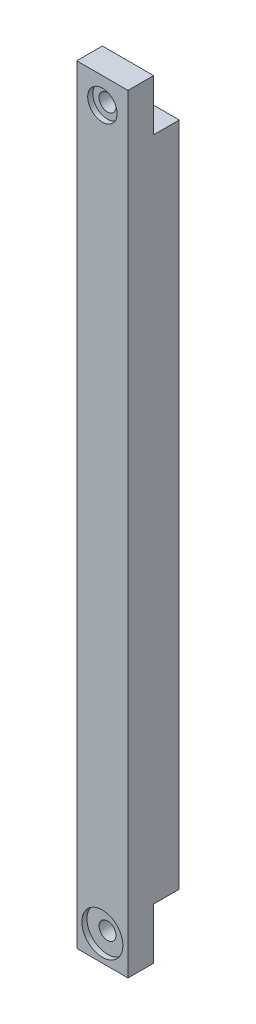
ISO-10303-21;
HEADER;
FILE_DESCRIPTION(('STEP AP214'),'2;1');
FILE_NAME('part.step','',(''),(''),'','','');
FILE_SCHEMA(('AUTOMOTIVE_DESIGN { 1 0 10303 214 1 1 1 1 }'));
ENDSEC;
DATA;
#1=APPLICATION_CONTEXT('core data for automotive mechanical design processes');
#2=APPLICATION_PROTOCOL_DEFINITION('international standard','automotive_design',2000,#1);
#3=PRODUCT_CONTEXT('',#1,'mechanical');
#4=PRODUCT('Part','Part','',(#3));
#5=PRODUCT_RELATED_PRODUCT_CATEGORY('part','',(#4));
#6=PRODUCT_DEFINITION_FORMATION('','',#4);
#7=PRODUCT_DEFINITION_CONTEXT('part definition',#1,'design');
#8=PRODUCT_DEFINITION('design','',#6,#7);
#9=PRODUCT_DEFINITION_SHAPE('','',#8);
#10=(LENGTH_UNIT() NAMED_UNIT(*) SI_UNIT(.MILLI.,.METRE.));
#11=(NAMED_UNIT(*) PLANE_ANGLE_UNIT() SI_UNIT($,.RADIAN.));
#12=(NAMED_UNIT(*) SI_UNIT($,.STERADIAN.) SOLID_ANGLE_UNIT());
#13=UNCERTAINTY_MEASURE_WITH_UNIT(LENGTH_MEASURE(1.E-05),#10,'distance_accuracy_value','');
#14=(GEOMETRIC_REPRESENTATION_CONTEXT(3) GLOBAL_UNCERTAINTY_ASSIGNED_CONTEXT((#13)) GLOBAL_UNIT_ASSIGNED_CONTEXT((#10,
#11,#12)) REPRESENTATION_CONTEXT('',''));
#15=CARTESIAN_POINT('',(0.,0.,0.));
#16=DIRECTION('',(0.,0.,1.));
#17=DIRECTION('',(1.,0.,0.));
#18=AXIS2_PLACEMENT_3D('',#15,#16,#17);
#19=CARTESIAN_POINT('',(5.00000000000003,-145.,10.));
#20=DIRECTION('',(0.,0.,1.));
#21=DIRECTION('',(1.,0.,0.));
#22=AXIS2_PLACEMENT_3D('',#19,#20,#21);
#23=CYLINDRICAL_SURFACE('',#22,1.65);
#24=CARTESIAN_POINT('',(5.00000000000003,-145.,5.));
#25=DIRECTION('',(0.,0.,1.));
#26=DIRECTION('',(1.,0.,0.));
#27=AXIS2_PLACEMENT_3D('',#24,#25,#26);
#28=CIRCLE('',#27,1.65);
#29=CARTESIAN_POINT('',(6.65000000000003,-145.,5.));
#30=VERTEX_POINT('',#29);
#31=EDGE_CURVE('E145',#30,#30,#28,.T.);
#32=ORIENTED_EDGE('',*,*,#31,.F.);
#33=EDGE_LOOP('',(#32));
#34=FACE_BOUND('',#33,.T.);
#35=CARTESIAN_POINT('',(5.00000000000003,-145.,9.));
#36=DIRECTION('',(0.,0.,1.));
#37=DIRECTION('',(1.,0.,0.));
#38=AXIS2_PLACEMENT_3D('',#35,#36,#37);
#39=CIRCLE('',#38,1.65);
#40=CARTESIAN_POINT('',(6.65000000000003,-145.,9.));
#41=VERTEX_POINT('',#40);
#42=EDGE_CURVE('E42',#41,#41,#39,.F.);
#43=ORIENTED_EDGE('',*,*,#42,.F.);
#44=EDGE_LOOP('',(#43));
#45=FACE_BOUND('',#44,.T.);
#46=ADVANCED_FACE('F38',(#34,#45),#23,.F.);
#47=CARTESIAN_POINT('',(5.00000000000001,-5.,10.));
#48=DIRECTION('',(0.,0.,1.));
#49=DIRECTION('',(1.,0.,0.));
#50=AXIS2_PLACEMENT_3D('',#47,#48,#49);
#51=CYLINDRICAL_SURFACE('',#50,1.65);
#52=CARTESIAN_POINT('',(5.00000000000001,-5.,5.));
#53=DIRECTION('',(0.,0.,-1.));
#54=DIRECTION('',(-1.,0.,0.));
#55=AXIS2_PLACEMENT_3D('',#52,#53,#54);
#56=CIRCLE('',#55,1.65);
#57=CARTESIAN_POINT('',(3.35000000000001,-5.,5.));
#58=VERTEX_POINT('',#57);
#59=EDGE_CURVE('E173',#58,#58,#56,.T.);
#60=ORIENTED_EDGE('',*,*,#59,.T.);
#61=EDGE_LOOP('',(#60));
#62=FACE_BOUND('',#61,.T.);
#63=CARTESIAN_POINT('',(5.00000000000001,-5.,9.));
#64=DIRECTION('',(0.,0.,1.));
#65=DIRECTION('',(1.,0.,0.));
#66=AXIS2_PLACEMENT_3D('',#63,#64,#65);
#67=CIRCLE('',#66,1.65);
#68=CARTESIAN_POINT('',(6.65000000000001,-5.,9.));
#69=VERTEX_POINT('',#68);
#70=EDGE_CURVE('E167',#69,#69,#67,.F.);
#71=ORIENTED_EDGE('',*,*,#70,.F.);
#72=EDGE_LOOP('',(#71));
#73=FACE_BOUND('',#72,.T.);
#74=ADVANCED_FACE('F215',(#62,#73),#51,.F.);
#75=CARTESIAN_POINT('',(0.,0.,10.));
#76=DIRECTION('',(0.,-1.,0.));
#77=DIRECTION('',(0.,0.,-1.));
#78=AXIS2_PLACEMENT_3D('',#75,#76,#77);
#79=PLANE('',#78);
#80=DIRECTION('',(1.,0.,0.));
#81=VECTOR('',#80,1.);
#82=CARTESIAN_POINT('',(10.,0.,5.));
#83=LINE('',#82,#81);
#84=CARTESIAN_POINT('',(0.,0.,5.));
#85=VERTEX_POINT('',#84);
#86=CARTESIAN_POINT('',(10.,0.,5.));
#87=VERTEX_POINT('',#86);
#88=EDGE_CURVE('E117',#85,#87,#83,.T.);
#89=ORIENTED_EDGE('',*,*,#88,.F.);
#90=DIRECTION('',(0.,0.,-1.));
#91=VECTOR('',#90,1.);
#92=CARTESIAN_POINT('',(0.,0.,10.));
#93=LINE('',#92,#91);
#94=CARTESIAN_POINT('',(0.,0.,10.));
#95=VERTEX_POINT('',#94);
#96=EDGE_CURVE('E158',#95,#85,#93,.T.);
#97=ORIENTED_EDGE('',*,*,#96,.F.);
#98=DIRECTION('',(-1.,0.,0.));
#99=VECTOR('',#98,1.);
#100=CARTESIAN_POINT('',(0.,0.,10.));
#101=LINE('',#100,#99);
#102=CARTESIAN_POINT('',(10.,0.,10.));
#103=VERTEX_POINT('',#102);
#104=EDGE_CURVE('E156',#103,#95,#101,.T.);
#105=ORIENTED_EDGE('',*,*,#104,.F.);
#106=DIRECTION('',(0.,0.,-1.));
#107=VECTOR('',#106,1.);
#108=CARTESIAN_POINT('',(10.,0.,10.));
#109=LINE('',#108,#107);
#110=EDGE_CURVE('E164',#103,#87,#109,.T.);
#111=ORIENTED_EDGE('',*,*,#110,.T.);
#112=EDGE_LOOP('',(#89,#97,#105,#111));
#113=FACE_BOUND('',#112,.T.);
#114=ADVANCED_FACE('F213',(#113),#79,.F.);
#115=CARTESIAN_POINT('',(0.,0.,10.));
#116=DIRECTION('',(1.,0.,0.));
#117=DIRECTION('',(0.,1.,0.));
#118=AXIS2_PLACEMENT_3D('',#115,#116,#117);
#119=PLANE('',#118);
#120=DIRECTION('',(0.,1.,0.));
#121=VECTOR('',#120,1.);
#122=CARTESIAN_POINT('',(0.,0.,5.));
#123=LINE('',#122,#121);
#124=CARTESIAN_POINT('',(0.,-10.,5.));
#125=VERTEX_POINT('',#124);
#126=EDGE_CURVE('E111',#125,#85,#123,.T.);
#127=ORIENTED_EDGE('',*,*,#126,.F.);
#128=DIRECTION('',(0.,0.,-1.));
#129=VECTOR('',#128,1.);
#130=CARTESIAN_POINT('',(0.,-10.,5.));
#131=LINE('',#130,#129);
#132=CARTESIAN_POINT('',(0.,-10.,0.));
#133=VERTEX_POINT('',#132);
#134=EDGE_CURVE('E108',#125,#133,#131,.T.);
#135=ORIENTED_EDGE('',*,*,#134,.T.);
#136=DIRECTION('',(0.,-1.,0.));
#137=VECTOR('',#136,1.);
#138=CARTESIAN_POINT('',(0.,0.,0.));
#139=LINE('',#138,#137);
#140=CARTESIAN_POINT('',(0.,-140.,0.));
#141=VERTEX_POINT('',#140);
#142=EDGE_CURVE('E129',#133,#141,#139,.T.);
#143=ORIENTED_EDGE('',*,*,#142,.T.);
#144=DIRECTION('',(0.,0.,-1.));
#145=VECTOR('',#144,1.);
#146=CARTESIAN_POINT('',(0.,-140.,5.));
#147=LINE('',#146,#145);
#148=CARTESIAN_POINT('',(0.,-140.,5.));
#149=VERTEX_POINT('',#148);
#150=EDGE_CURVE('E63',#149,#141,#147,.T.);
#151=ORIENTED_EDGE('',*,*,#150,.F.);
#152=DIRECTION('',(0.,1.,0.));
#153=VECTOR('',#152,1.);
#154=CARTESIAN_POINT('',(0.,-150.,5.));
#155=LINE('',#154,#153);
#156=CARTESIAN_POINT('',(0.,-150.,5.));
#157=VERTEX_POINT('',#156);
#158=EDGE_CURVE('E139',#157,#149,#155,.T.);
#159=ORIENTED_EDGE('',*,*,#158,.F.);
#160=DIRECTION('',(0.,0.,-1.));
#161=VECTOR('',#160,1.);
#162=CARTESIAN_POINT('',(0.,-150.,10.));
#163=LINE('',#162,#161);
#164=CARTESIAN_POINT('',(0.,-150.,10.));
#165=VERTEX_POINT('',#164);
#166=EDGE_CURVE('E11',#165,#157,#163,.T.);
#167=ORIENTED_EDGE('',*,*,#166,.F.);
#168=DIRECTION('',(0.,-1.,0.));
#169=VECTOR('',#168,1.);
#170=CARTESIAN_POINT('',(0.,0.,10.));
#171=LINE('',#170,#169);
#172=EDGE_CURVE('E149',#95,#165,#171,.T.);
#173=ORIENTED_EDGE('',*,*,#172,.F.);
#174=ORIENTED_EDGE('',*,*,#96,.T.);
#175=EDGE_LOOP('',(#127,#135,#143,#151,#159,#167,#173,#174));
#176=FACE_BOUND('',#175,.T.);
#177=ADVANCED_FACE('F40',(#176),#119,.F.);
#178=CARTESIAN_POINT('',(0.,-150.,10.));
#179=DIRECTION('',(0.,1.,0.));
#180=DIRECTION('',(0.,0.,1.));
#181=AXIS2_PLACEMENT_3D('',#178,#179,#180);
#182=PLANE('',#181);
#183=ORIENTED_EDGE('',*,*,#166,.T.);
#184=DIRECTION('',(-1.,0.,0.));
#185=VECTOR('',#184,1.);
#186=CARTESIAN_POINT('',(10.,-150.,5.));
#187=LINE('',#186,#185);
#188=CARTESIAN_POINT('',(10.,-150.,5.));
#189=VERTEX_POINT('',#188);
#190=EDGE_CURVE('E136',#189,#157,#187,.T.);
#191=ORIENTED_EDGE('',*,*,#190,.F.);
#192=DIRECTION('',(0.,0.,-1.));
#193=VECTOR('',#192,1.);
#194=CARTESIAN_POINT('',(10.,-150.,10.));
#195=LINE('',#194,#193);
#196=CARTESIAN_POINT('',(10.,-150.,10.));
#197=VERTEX_POINT('',#196);
#198=EDGE_CURVE('E47',#197,#189,#195,.T.);
#199=ORIENTED_EDGE('',*,*,#198,.F.);
#200=DIRECTION('',(1.,0.,0.));
#201=VECTOR('',#200,1.);
#202=CARTESIAN_POINT('',(0.,-150.,10.));
#203=LINE('',#202,#201);
#204=EDGE_CURVE('E152',#165,#197,#203,.T.);
#205=ORIENTED_EDGE('',*,*,#204,.F.);
#206=EDGE_LOOP('',(#183,#191,#199,#205));
#207=FACE_BOUND('',#206,.T.);
#208=ADVANCED_FACE('F205',(#207),#182,.F.);
#209=CARTESIAN_POINT('',(10.,0.,10.));
#210=DIRECTION('',(-1.,0.,0.));
#211=DIRECTION('',(0.,-1.,0.));
#212=AXIS2_PLACEMENT_3D('',#209,#210,#211);
#213=PLANE('',#212);
#214=DIRECTION('',(0.,1.,0.));
#215=VECTOR('',#214,1.);
#216=CARTESIAN_POINT('',(10.,0.,0.));
#217=LINE('',#216,#215);
#218=CARTESIAN_POINT('',(10.,-140.,0.));
#219=VERTEX_POINT('',#218);
#220=CARTESIAN_POINT('',(10.,-10.,0.));
#221=VERTEX_POINT('',#220);
#222=EDGE_CURVE('E127',#219,#221,#217,.T.);
#223=ORIENTED_EDGE('',*,*,#222,.T.);
#224=DIRECTION('',(0.,0.,-1.));
#225=VECTOR('',#224,1.);
#226=CARTESIAN_POINT('',(10.,-10.,5.));
#227=LINE('',#226,#225);
#228=CARTESIAN_POINT('',(10.,-10.,5.));
#229=VERTEX_POINT('',#228);
#230=EDGE_CURVE('E55',#229,#221,#227,.T.);
#231=ORIENTED_EDGE('',*,*,#230,.F.);
#232=DIRECTION('',(0.,-1.,0.));
#233=VECTOR('',#232,1.);
#234=CARTESIAN_POINT('',(10.,0.,5.));
#235=LINE('',#234,#233);
#236=EDGE_CURVE('E112',#87,#229,#235,.T.);
#237=ORIENTED_EDGE('',*,*,#236,.F.);
#238=ORIENTED_EDGE('',*,*,#110,.F.);
#239=DIRECTION('',(0.,1.,0.));
#240=VECTOR('',#239,1.);
#241=CARTESIAN_POINT('',(10.,0.,10.));
#242=LINE('',#241,#240);
#243=EDGE_CURVE('E154',#197,#103,#242,.T.);
#244=ORIENTED_EDGE('',*,*,#243,.F.);
#245=ORIENTED_EDGE('',*,*,#198,.T.);
#246=DIRECTION('',(0.,-1.,0.));
#247=VECTOR('',#246,1.);
#248=CARTESIAN_POINT('',(10.,-150.,5.));
#249=LINE('',#248,#247);
#250=CARTESIAN_POINT('',(10.,-140.,5.));
#251=VERTEX_POINT('',#250);
#252=EDGE_CURVE('E134',#251,#189,#249,.T.);
#253=ORIENTED_EDGE('',*,*,#252,.F.);
#254=DIRECTION('',(0.,0.,-1.));
#255=VECTOR('',#254,1.);
#256=CARTESIAN_POINT('',(10.,-140.,5.));
#257=LINE('',#256,#255);
#258=EDGE_CURVE('E146',#251,#219,#257,.T.);
#259=ORIENTED_EDGE('',*,*,#258,.T.);
#260=EDGE_LOOP('',(#223,#231,#237,#238,#244,#245,#253,#259));
#261=FACE_BOUND('',#260,.T.);
#262=ADVANCED_FACE('F124',(#261),#213,.F.);
#263=CARTESIAN_POINT('',(0.,0.,10.));
#264=DIRECTION('',(0.,0.,1.));
#265=DIRECTION('',(1.,0.,0.));
#266=AXIS2_PLACEMENT_3D('',#263,#264,#265);
#267=PLANE('',#266);
#268=CARTESIAN_POINT('',(5.00000000000001,-5.,10.));
#269=DIRECTION('',(0.,0.,1.));
#270=DIRECTION('',(1.,0.,0.));
#271=AXIS2_PLACEMENT_3D('',#268,#269,#270);
#272=CIRCLE('',#271,2.86805295159104);
#273=CARTESIAN_POINT('',(7.86805295159104,-5.,10.));
#274=VERTEX_POINT('',#273);
#275=EDGE_CURVE('E175',#274,#274,#272,.T.);
#276=ORIENTED_EDGE('',*,*,#275,.F.);
#277=EDGE_LOOP('',(#276));
#278=FACE_BOUND('',#277,.T.);
#279=CARTESIAN_POINT('',(5.00000000000001,-145.,10.));
#280=DIRECTION('',(0.,0.,1.));
#281=DIRECTION('',(1.,0.,0.));
#282=AXIS2_PLACEMENT_3D('',#279,#280,#281);
#283=CIRCLE('',#282,4.);
#284=CARTESIAN_POINT('',(9.00000000000001,-145.,10.));
#285=VERTEX_POINT('',#284);
#286=EDGE_CURVE('E185',#285,#285,#283,.T.);
#287=ORIENTED_EDGE('',*,*,#286,.F.);
#288=EDGE_LOOP('',(#287));
#289=FACE_BOUND('',#288,.T.);
#290=ORIENTED_EDGE('',*,*,#172,.T.);
#291=ORIENTED_EDGE('',*,*,#204,.T.);
#292=ORIENTED_EDGE('',*,*,#243,.T.);
#293=ORIENTED_EDGE('',*,*,#104,.T.);
#294=EDGE_LOOP('',(#290,#291,#292,#293));
#295=FACE_BOUND('',#294,.T.);
#296=ADVANCED_FACE('F210',(#278,#289,#295),#267,.T.);
#297=CARTESIAN_POINT('',(0.,0.,0.));
#298=DIRECTION('',(0.,0.,1.));
#299=DIRECTION('',(1.,0.,0.));
#300=AXIS2_PLACEMENT_3D('',#297,#298,#299);
#301=PLANE('',#300);
#302=ORIENTED_EDGE('',*,*,#142,.F.);
#303=DIRECTION('',(-1.,0.,0.));
#304=VECTOR('',#303,1.);
#305=CARTESIAN_POINT('',(10.,-10.,0.));
#306=LINE('',#305,#304);
#307=EDGE_CURVE('E121',#221,#133,#306,.T.);
#308=ORIENTED_EDGE('',*,*,#307,.F.);
#309=ORIENTED_EDGE('',*,*,#222,.F.);
#310=DIRECTION('',(1.,0.,0.));
#311=VECTOR('',#310,1.);
#312=CARTESIAN_POINT('',(10.,-140.,0.));
#313=LINE('',#312,#311);
#314=EDGE_CURVE('E137',#141,#219,#313,.T.);
#315=ORIENTED_EDGE('',*,*,#314,.F.);
#316=EDGE_LOOP('',(#302,#308,#309,#315));
#317=FACE_BOUND('',#316,.T.);
#318=ADVANCED_FACE('F195',(#317),#301,.F.);
#319=CARTESIAN_POINT('',(10.,-140.,5.));
#320=DIRECTION('',(0.,1.,0.));
#321=DIRECTION('',(0.,0.,1.));
#322=AXIS2_PLACEMENT_3D('',#319,#320,#321);
#323=PLANE('',#322);
#324=ORIENTED_EDGE('',*,*,#314,.T.);
#325=ORIENTED_EDGE('',*,*,#258,.F.);
#326=DIRECTION('',(1.,0.,0.));
#327=VECTOR('',#326,1.);
#328=CARTESIAN_POINT('',(10.,-140.,5.));
#329=LINE('',#328,#327);
#330=EDGE_CURVE('E141',#149,#251,#329,.T.);
#331=ORIENTED_EDGE('',*,*,#330,.F.);
#332=ORIENTED_EDGE('',*,*,#150,.T.);
#333=EDGE_LOOP('',(#324,#325,#331,#332));
#334=FACE_BOUND('',#333,.T.);
#335=ADVANCED_FACE('F196',(#334),#323,.F.);
#336=CARTESIAN_POINT('',(0.,0.,5.));
#337=DIRECTION('',(0.,0.,1.));
#338=DIRECTION('',(1.,0.,0.));
#339=AXIS2_PLACEMENT_3D('',#336,#337,#338);
#340=PLANE('',#339);
#341=ORIENTED_EDGE('',*,*,#31,.T.);
#342=EDGE_LOOP('',(#341));
#343=FACE_BOUND('',#342,.T.);
#344=ORIENTED_EDGE('',*,*,#252,.T.);
#345=ORIENTED_EDGE('',*,*,#190,.T.);
#346=ORIENTED_EDGE('',*,*,#158,.T.);
#347=ORIENTED_EDGE('',*,*,#330,.T.);
#348=EDGE_LOOP('',(#344,#345,#346,#347));
#349=FACE_BOUND('',#348,.T.);
#350=ADVANCED_FACE('F202',(#343,#349),#340,.F.);
#351=CARTESIAN_POINT('',(10.,-10.,5.));
#352=DIRECTION('',(0.,-1.,0.));
#353=DIRECTION('',(0.,0.,-1.));
#354=AXIS2_PLACEMENT_3D('',#351,#352,#353);
#355=PLANE('',#354);
#356=ORIENTED_EDGE('',*,*,#307,.T.);
#357=ORIENTED_EDGE('',*,*,#134,.F.);
#358=DIRECTION('',(-1.,0.,0.));
#359=VECTOR('',#358,1.);
#360=CARTESIAN_POINT('',(10.,-10.,5.));
#361=LINE('',#360,#359);
#362=EDGE_CURVE('E104',#229,#125,#361,.T.);
#363=ORIENTED_EDGE('',*,*,#362,.F.);
#364=ORIENTED_EDGE('',*,*,#230,.T.);
#365=EDGE_LOOP('',(#356,#357,#363,#364));
#366=FACE_BOUND('',#365,.T.);
#367=ADVANCED_FACE('F106',(#366),#355,.F.);
#368=CARTESIAN_POINT('',(0.,0.,5.));
#369=DIRECTION('',(0.,0.,-1.));
#370=DIRECTION('',(-1.,0.,0.));
#371=AXIS2_PLACEMENT_3D('',#368,#369,#370);
#372=PLANE('',#371);
#373=ORIENTED_EDGE('',*,*,#59,.F.);
#374=EDGE_LOOP('',(#373));
#375=FACE_BOUND('',#374,.T.);
#376=ORIENTED_EDGE('',*,*,#236,.T.);
#377=ORIENTED_EDGE('',*,*,#362,.T.);
#378=ORIENTED_EDGE('',*,*,#126,.T.);
#379=ORIENTED_EDGE('',*,*,#88,.T.);
#380=EDGE_LOOP('',(#376,#377,#378,#379));
#381=FACE_BOUND('',#380,.T.);
#382=ADVANCED_FACE('F115',(#375,#381),#372,.T.);
#383=CARTESIAN_POINT('',(5.00000000000001,-5.,9.));
#384=DIRECTION('',(0.,0.,1.));
#385=DIRECTION('',(1.,0.,0.));
#386=AXIS2_PLACEMENT_3D('',#383,#384,#385);
#387=PLANE('',#386);
#388=CARTESIAN_POINT('',(5.00000000000001,-5.,9.));
#389=DIRECTION('',(0.,0.,1.));
#390=DIRECTION('',(1.,0.,0.));
#391=AXIS2_PLACEMENT_3D('',#388,#389,#390);
#392=CIRCLE('',#391,2.86805295159104);
#393=CARTESIAN_POINT('',(7.86805295159104,-5.,9.));
#394=VERTEX_POINT('',#393);
#395=EDGE_CURVE('E169',#394,#394,#392,.T.);
#396=ORIENTED_EDGE('',*,*,#395,.T.);
#397=EDGE_LOOP('',(#396));
#398=FACE_BOUND('',#397,.T.);
#399=ORIENTED_EDGE('',*,*,#70,.T.);
#400=EDGE_LOOP('',(#399));
#401=FACE_BOUND('',#400,.T.);
#402=ADVANCED_FACE('F236',(#398,#401),#387,.T.);
#403=CARTESIAN_POINT('',(5.00000000000001,-5.,9.));
#404=DIRECTION('',(0.,0.,1.));
#405=DIRECTION('',(1.,0.,0.));
#406=AXIS2_PLACEMENT_3D('',#403,#404,#405);
#407=CYLINDRICAL_SURFACE('',#406,2.86805295159104);
#408=ORIENTED_EDGE('',*,*,#395,.F.);
#409=EDGE_LOOP('',(#408));
#410=FACE_BOUND('',#409,.T.);
#411=ORIENTED_EDGE('',*,*,#275,.T.);
#412=EDGE_LOOP('',(#411));
#413=FACE_BOUND('',#412,.T.);
#414=ADVANCED_FACE('F277',(#410,#413),#407,.F.);
#415=CARTESIAN_POINT('',(5.00000000000001,-145.,9.));
#416=DIRECTION('',(0.,0.,1.));
#417=DIRECTION('',(1.,0.,0.));
#418=AXIS2_PLACEMENT_3D('',#415,#416,#417);
#419=PLANE('',#418);
#420=CARTESIAN_POINT('',(5.00000000000001,-145.,9.));
#421=DIRECTION('',(0.,0.,1.));
#422=DIRECTION('',(1.,0.,0.));
#423=AXIS2_PLACEMENT_3D('',#420,#421,#422);
#424=CIRCLE('',#423,4.);
#425=CARTESIAN_POINT('',(9.00000000000001,-145.,9.));
#426=VERTEX_POINT('',#425);
#427=EDGE_CURVE('E180',#426,#426,#424,.T.);
#428=ORIENTED_EDGE('',*,*,#427,.T.);
#429=EDGE_LOOP('',(#428));
#430=FACE_BOUND('',#429,.T.);
#431=ORIENTED_EDGE('',*,*,#42,.T.);
#432=EDGE_LOOP('',(#431));
#433=FACE_BOUND('',#432,.T.);
#434=ADVANCED_FACE('F284',(#430,#433),#419,.T.);
#435=CARTESIAN_POINT('',(5.00000000000001,-145.,9.));
#436=DIRECTION('',(0.,0.,1.));
#437=DIRECTION('',(1.,0.,0.));
#438=AXIS2_PLACEMENT_3D('',#435,#436,#437);
#439=CYLINDRICAL_SURFACE('',#438,4.);
#440=ORIENTED_EDGE('',*,*,#427,.F.);
#441=EDGE_LOOP('',(#440));
#442=FACE_BOUND('',#441,.T.);
#443=ORIENTED_EDGE('',*,*,#286,.T.);
#444=EDGE_LOOP('',(#443));
#445=FACE_BOUND('',#444,.T.);
#446=ADVANCED_FACE('F292',(#442,#445),#439,.F.);
#447=CLOSED_SHELL('',(#46,#74,#114,#177,#208,#262,#296,#318,#335,#350,#367,#382,#402,#414,#434,#446));
#448=MANIFOLD_SOLID_BREP('B2',#447);
#449=ADVANCED_BREP_SHAPE_REPRESENTATION('',(#18,#448),#14);
#450=SHAPE_DEFINITION_REPRESENTATION(#9,#449);
ENDSEC;
END-ISO-10303-21;
